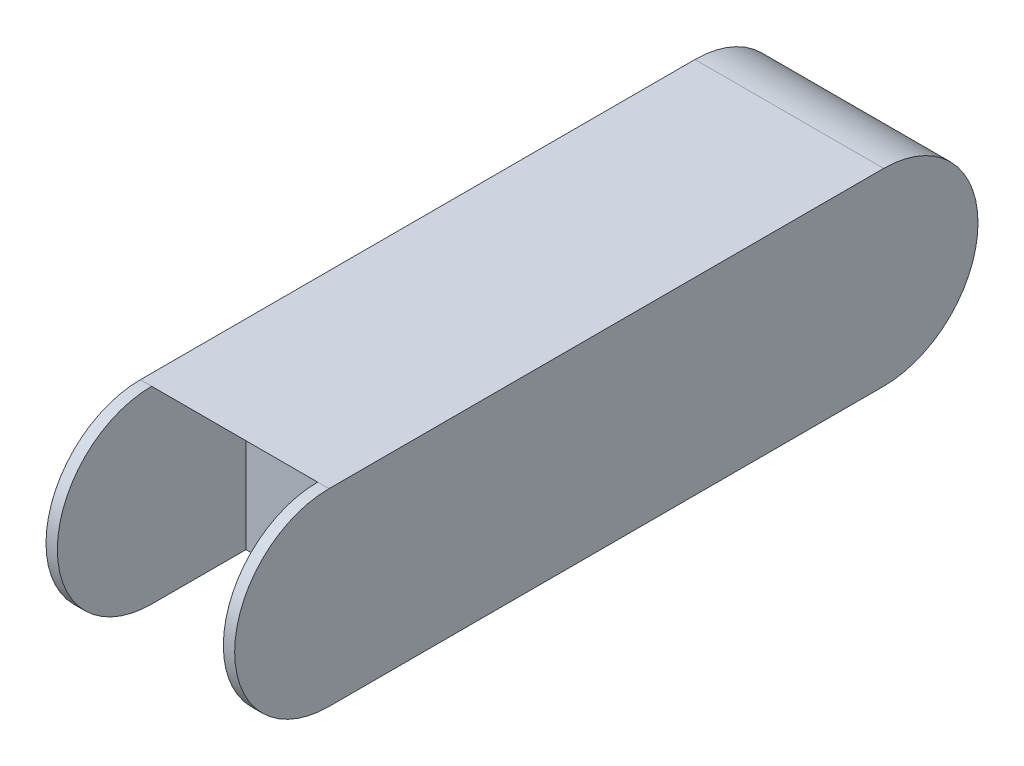
ISO-10303-21;
HEADER;
FILE_DESCRIPTION(('STEP AP214'),'2;1');
FILE_NAME('part.step','',(''),(''),'','','');
FILE_SCHEMA(('AUTOMOTIVE_DESIGN { 1 0 10303 214 1 1 1 1 }'));
ENDSEC;
DATA;
#1=APPLICATION_CONTEXT('core data for automotive mechanical design processes');
#2=APPLICATION_PROTOCOL_DEFINITION('international standard','automotive_design',2000,#1);
#3=PRODUCT_CONTEXT('',#1,'mechanical');
#4=PRODUCT('Part','Part','',(#3));
#5=PRODUCT_RELATED_PRODUCT_CATEGORY('part','',(#4));
#6=PRODUCT_DEFINITION_FORMATION('','',#4);
#7=PRODUCT_DEFINITION_CONTEXT('part definition',#1,'design');
#8=PRODUCT_DEFINITION('design','',#6,#7);
#9=PRODUCT_DEFINITION_SHAPE('','',#8);
#10=(LENGTH_UNIT() NAMED_UNIT(*) SI_UNIT(.MILLI.,.METRE.));
#11=(NAMED_UNIT(*) PLANE_ANGLE_UNIT() SI_UNIT($,.RADIAN.));
#12=(NAMED_UNIT(*) SI_UNIT($,.STERADIAN.) SOLID_ANGLE_UNIT());
#13=UNCERTAINTY_MEASURE_WITH_UNIT(LENGTH_MEASURE(1.E-05),#10,'distance_accuracy_value','');
#14=(GEOMETRIC_REPRESENTATION_CONTEXT(3) GLOBAL_UNCERTAINTY_ASSIGNED_CONTEXT((#13)) GLOBAL_UNIT_ASSIGNED_CONTEXT((#10,
#11,#12)) REPRESENTATION_CONTEXT('',''));
#15=CARTESIAN_POINT('',(0.,0.,0.));
#16=DIRECTION('',(0.,0.,1.));
#17=DIRECTION('',(1.,0.,0.));
#18=AXIS2_PLACEMENT_3D('',#15,#16,#17);
#19=CARTESIAN_POINT('',(0.,0.025,-0.025));
#20=DIRECTION('',(0.,0.,-1.));
#21=DIRECTION('',(-1.,0.,0.));
#22=AXIS2_PLACEMENT_3D('',#19,#20,#21);
#23=PLANE('',#22);
#24=DIRECTION('',(1.,0.,0.));
#25=VECTOR('',#24,1.);
#26=CARTESIAN_POINT('',(0.,0.,-0.025));
#27=LINE('',#26,#25);
#28=CARTESIAN_POINT('',(0.003,0.,-0.025));
#29=VERTEX_POINT('',#28);
#30=CARTESIAN_POINT('',(0.047,0.,-0.025));
#31=VERTEX_POINT('',#30);
#32=EDGE_CURVE('E107',#29,#31,#27,.T.);
#33=ORIENTED_EDGE('',*,*,#32,.T.);
#34=DIRECTION('',(0.,1.,0.));
#35=VECTOR('',#34,1.);
#36=CARTESIAN_POINT('',(0.047,0.025,-0.025));
#37=LINE('',#36,#35);
#38=CARTESIAN_POINT('',(0.047,0.025,-0.025));
#39=VERTEX_POINT('',#38);
#40=EDGE_CURVE('E101',#31,#39,#37,.T.);
#41=ORIENTED_EDGE('',*,*,#40,.T.);
#42=DIRECTION('',(1.,0.,0.));
#43=VECTOR('',#42,1.);
#44=CARTESIAN_POINT('',(0.,0.025,-0.025));
#45=LINE('',#44,#43);
#46=CARTESIAN_POINT('',(0.003,0.0249999999999998,-0.025));
#47=VERTEX_POINT('',#46);
#48=EDGE_CURVE('E104',#47,#39,#45,.T.);
#49=ORIENTED_EDGE('',*,*,#48,.F.);
#50=DIRECTION('',(0.,-1.,0.));
#51=VECTOR('',#50,1.);
#52=CARTESIAN_POINT('',(0.003,0.0249999999999998,-0.025));
#53=LINE('',#52,#51);
#54=EDGE_CURVE('E167',#47,#29,#53,.T.);
#55=ORIENTED_EDGE('',*,*,#54,.T.);
#56=EDGE_LOOP('',(#33,#41,#49,#55));
#57=FACE_BOUND('',#56,.T.);
#58=ADVANCED_FACE('F34',(#57),#23,.F.);
#59=CARTESIAN_POINT('',(0.003,0.025,0.));
#60=DIRECTION('',(-1.,0.,0.));
#61=DIRECTION('',(0.,0.,1.));
#62=AXIS2_PLACEMENT_3D('',#59,#60,#61);
#63=CYLINDRICAL_SURFACE('',#62,0.025);
#64=CARTESIAN_POINT('',(0.,0.025,0.));
#65=DIRECTION('',(-1.,0.,0.));
#66=DIRECTION('',(0.,0.,1.));
#67=AXIS2_PLACEMENT_3D('',#64,#65,#66);
#68=CIRCLE('',#67,0.025);
#69=CARTESIAN_POINT('',(0.,0.,0.));
#70=VERTEX_POINT('',#69);
#71=CARTESIAN_POINT('',(0.,0.05,0.));
#72=VERTEX_POINT('',#71);
#73=EDGE_CURVE('E160',#70,#72,#68,.T.);
#74=ORIENTED_EDGE('',*,*,#73,.F.);
#75=DIRECTION('',(-1.,0.,0.));
#76=VECTOR('',#75,1.);
#77=CARTESIAN_POINT('',(0.003,0.,0.));
#78=LINE('',#77,#76);
#79=CARTESIAN_POINT('',(0.003,0.,0.));
#80=VERTEX_POINT('',#79);
#81=EDGE_CURVE('E161',#80,#70,#78,.T.);
#82=ORIENTED_EDGE('',*,*,#81,.F.);
#83=CARTESIAN_POINT('',(0.003,0.025,0.));
#84=DIRECTION('',(-1.,0.,0.));
#85=DIRECTION('',(0.,0.,1.));
#86=AXIS2_PLACEMENT_3D('',#83,#84,#85);
#87=CIRCLE('',#86,0.025);
#88=CARTESIAN_POINT('',(0.003,0.05,0.));
#89=VERTEX_POINT('',#88);
#90=EDGE_CURVE('E57',#80,#89,#87,.T.);
#91=ORIENTED_EDGE('',*,*,#90,.T.);
#92=DIRECTION('',(-1.,0.,0.));
#93=VECTOR('',#92,1.);
#94=CARTESIAN_POINT('',(0.003,0.05,0.));
#95=LINE('',#94,#93);
#96=EDGE_CURVE('E129',#89,#72,#95,.T.);
#97=ORIENTED_EDGE('',*,*,#96,.T.);
#98=EDGE_LOOP('',(#74,#82,#91,#97));
#99=FACE_BOUND('',#98,.T.);
#100=ADVANCED_FACE('F179',(#99),#63,.T.);
#101=CARTESIAN_POINT('',(0.05,0.025,0.));
#102=DIRECTION('',(-1.,0.,0.));
#103=DIRECTION('',(0.,0.,1.));
#104=AXIS2_PLACEMENT_3D('',#101,#102,#103);
#105=CYLINDRICAL_SURFACE('',#104,0.025);
#106=EDGE_CURVE('E119',#89,#47,#87,.T.);
#107=ORIENTED_EDGE('',*,*,#106,.T.);
#108=ORIENTED_EDGE('',*,*,#48,.T.);
#109=CARTESIAN_POINT('',(0.047,0.025,0.));
#110=DIRECTION('',(1.,0.,0.));
#111=DIRECTION('',(0.,0.,-1.));
#112=AXIS2_PLACEMENT_3D('',#109,#110,#111);
#113=CIRCLE('',#112,0.025);
#114=CARTESIAN_POINT('',(0.047,0.05,0.));
#115=VERTEX_POINT('',#114);
#116=EDGE_CURVE('E116',#39,#115,#113,.T.);
#117=ORIENTED_EDGE('',*,*,#116,.T.);
#118=DIRECTION('',(-1.,0.,0.));
#119=VECTOR('',#118,1.);
#120=CARTESIAN_POINT('',(0.05,0.05,0.));
#121=LINE('',#120,#119);
#122=EDGE_CURVE('E141',#115,#89,#121,.T.);
#123=ORIENTED_EDGE('',*,*,#122,.T.);
#124=EDGE_LOOP('',(#107,#108,#117,#123));
#125=FACE_BOUND('',#124,.T.);
#126=ADVANCED_FACE('F36',(#125),#105,.F.);
#127=CARTESIAN_POINT('',(0.05,0.,0.));
#128=DIRECTION('',(0.,1.,0.));
#129=DIRECTION('',(0.,0.,1.));
#130=AXIS2_PLACEMENT_3D('',#127,#128,#129);
#131=PLANE('',#130);
#132=DIRECTION('',(0.,0.,-1.));
#133=VECTOR('',#132,1.);
#134=CARTESIAN_POINT('',(0.05,0.,0.));
#135=LINE('',#134,#133);
#136=CARTESIAN_POINT('',(0.05,0.,0.));
#137=VERTEX_POINT('',#136);
#138=CARTESIAN_POINT('',(0.05,0.,-0.147));
#139=VERTEX_POINT('',#138);
#140=EDGE_CURVE('E134',#137,#139,#135,.T.);
#141=ORIENTED_EDGE('',*,*,#140,.F.);
#142=DIRECTION('',(1.,0.,0.));
#143=VECTOR('',#142,1.);
#144=CARTESIAN_POINT('',(0.047,0.,0.));
#145=LINE('',#144,#143);
#146=CARTESIAN_POINT('',(0.047,0.,0.));
#147=VERTEX_POINT('',#146);
#148=EDGE_CURVE('E169',#147,#137,#145,.T.);
#149=ORIENTED_EDGE('',*,*,#148,.F.);
#150=DIRECTION('',(0.,0.,-1.));
#151=VECTOR('',#150,1.);
#152=CARTESIAN_POINT('',(0.047,0.,-0.025));
#153=LINE('',#152,#151);
#154=EDGE_CURVE('E112',#147,#31,#153,.T.);
#155=ORIENTED_EDGE('',*,*,#154,.T.);
#156=ORIENTED_EDGE('',*,*,#32,.F.);
#157=DIRECTION('',(0.,0.,1.));
#158=VECTOR('',#157,1.);
#159=CARTESIAN_POINT('',(0.003,0.,-0.025));
#160=LINE('',#159,#158);
#161=EDGE_CURVE('E163',#29,#80,#160,.T.);
#162=ORIENTED_EDGE('',*,*,#161,.T.);
#163=ORIENTED_EDGE('',*,*,#81,.T.);
#164=DIRECTION('',(0.,0.,-1.));
#165=VECTOR('',#164,1.);
#166=CARTESIAN_POINT('',(0.,0.,0.));
#167=LINE('',#166,#165);
#168=CARTESIAN_POINT('',(0.,0.,-0.147));
#169=VERTEX_POINT('',#168);
#170=EDGE_CURVE('E49',#70,#169,#167,.T.);
#171=ORIENTED_EDGE('',*,*,#170,.T.);
#172=DIRECTION('',(-1.,0.,0.));
#173=VECTOR('',#172,1.);
#174=CARTESIAN_POINT('',(0.05,0.,-0.147));
#175=LINE('',#174,#173);
#176=EDGE_CURVE('E11',#139,#169,#175,.T.);
#177=ORIENTED_EDGE('',*,*,#176,.F.);
#178=EDGE_LOOP('',(#141,#149,#155,#156,#162,#163,#171,#177));
#179=FACE_BOUND('',#178,.T.);
#180=ADVANCED_FACE('F173',(#179),#131,.F.);
#181=CARTESIAN_POINT('',(0.05,0.025,-0.147));
#182=DIRECTION('',(-1.,0.,0.));
#183=DIRECTION('',(0.,0.,1.));
#184=AXIS2_PLACEMENT_3D('',#181,#182,#183);
#185=CYLINDRICAL_SURFACE('',#184,0.025);
#186=CARTESIAN_POINT('',(0.,0.025,-0.147));
#187=DIRECTION('',(1.,0.,0.));
#188=DIRECTION('',(0.,0.,-1.));
#189=AXIS2_PLACEMENT_3D('',#186,#187,#188);
#190=CIRCLE('',#189,0.025);
#191=CARTESIAN_POINT('',(0.,0.05,-0.147));
#192=VERTEX_POINT('',#191);
#193=EDGE_CURVE('E143',#169,#192,#190,.T.);
#194=ORIENTED_EDGE('',*,*,#193,.T.);
#195=DIRECTION('',(-1.,0.,0.));
#196=VECTOR('',#195,1.);
#197=CARTESIAN_POINT('',(0.05,0.05,-0.147));
#198=LINE('',#197,#196);
#199=CARTESIAN_POINT('',(0.05,0.05,-0.147));
#200=VERTEX_POINT('',#199);
#201=EDGE_CURVE('E42',#200,#192,#198,.T.);
#202=ORIENTED_EDGE('',*,*,#201,.F.);
#203=CARTESIAN_POINT('',(0.05,0.025,-0.147));
#204=DIRECTION('',(1.,0.,0.));
#205=DIRECTION('',(0.,0.,-1.));
#206=AXIS2_PLACEMENT_3D('',#203,#204,#205);
#207=CIRCLE('',#206,0.025);
#208=EDGE_CURVE('E136',#139,#200,#207,.T.);
#209=ORIENTED_EDGE('',*,*,#208,.F.);
#210=ORIENTED_EDGE('',*,*,#176,.T.);
#211=EDGE_LOOP('',(#194,#202,#209,#210));
#212=FACE_BOUND('',#211,.T.);
#213=ADVANCED_FACE('F201',(#212),#185,.T.);
#214=CARTESIAN_POINT('',(0.05,0.05,0.));
#215=DIRECTION('',(0.,-1.,0.));
#216=DIRECTION('',(0.,0.,-1.));
#217=AXIS2_PLACEMENT_3D('',#214,#215,#216);
#218=PLANE('',#217);
#219=DIRECTION('',(0.,0.,1.));
#220=VECTOR('',#219,1.);
#221=CARTESIAN_POINT('',(0.,0.05,0.));
#222=LINE('',#221,#220);
#223=EDGE_CURVE('E137',#192,#72,#222,.T.);
#224=ORIENTED_EDGE('',*,*,#223,.T.);
#225=ORIENTED_EDGE('',*,*,#96,.F.);
#226=ORIENTED_EDGE('',*,*,#122,.F.);
#227=CARTESIAN_POINT('',(0.05,0.05,0.));
#228=VERTEX_POINT('',#227);
#229=EDGE_CURVE('E147',#228,#115,#121,.T.);
#230=ORIENTED_EDGE('',*,*,#229,.F.);
#231=DIRECTION('',(0.,0.,1.));
#232=VECTOR('',#231,1.);
#233=CARTESIAN_POINT('',(0.05,0.05,0.));
#234=LINE('',#233,#232);
#235=EDGE_CURVE('E139',#200,#228,#234,.T.);
#236=ORIENTED_EDGE('',*,*,#235,.F.);
#237=ORIENTED_EDGE('',*,*,#201,.T.);
#238=EDGE_LOOP('',(#224,#225,#226,#230,#236,#237));
#239=FACE_BOUND('',#238,.T.);
#240=ADVANCED_FACE('F154',(#239),#218,.F.);
#241=CARTESIAN_POINT('',(0.05,0.025,0.));
#242=DIRECTION('',(1.,0.,0.));
#243=DIRECTION('',(0.,0.,-1.));
#244=AXIS2_PLACEMENT_3D('',#241,#242,#243);
#245=PLANE('',#244);
#246=CARTESIAN_POINT('',(0.05,0.025,0.));
#247=DIRECTION('',(1.,0.,0.));
#248=DIRECTION('',(0.,0.,-1.));
#249=AXIS2_PLACEMENT_3D('',#246,#247,#248);
#250=CIRCLE('',#249,0.025);
#251=EDGE_CURVE('E126',#228,#137,#250,.T.);
#252=ORIENTED_EDGE('',*,*,#251,.T.);
#253=ORIENTED_EDGE('',*,*,#140,.T.);
#254=ORIENTED_EDGE('',*,*,#208,.T.);
#255=ORIENTED_EDGE('',*,*,#235,.T.);
#256=EDGE_LOOP('',(#252,#253,#254,#255));
#257=FACE_BOUND('',#256,.T.);
#258=ADVANCED_FACE('F193',(#257),#245,.T.);
#259=CARTESIAN_POINT('',(0.,0.025,0.));
#260=DIRECTION('',(1.,0.,0.));
#261=DIRECTION('',(0.,0.,-1.));
#262=AXIS2_PLACEMENT_3D('',#259,#260,#261);
#263=PLANE('',#262);
#264=ORIENTED_EDGE('',*,*,#170,.F.);
#265=ORIENTED_EDGE('',*,*,#73,.T.);
#266=ORIENTED_EDGE('',*,*,#223,.F.);
#267=ORIENTED_EDGE('',*,*,#193,.F.);
#268=EDGE_LOOP('',(#264,#265,#266,#267));
#269=FACE_BOUND('',#268,.T.);
#270=ADVANCED_FACE('F158',(#269),#263,.F.);
#271=CARTESIAN_POINT('',(0.047,0.025,0.));
#272=DIRECTION('',(1.,0.,0.));
#273=DIRECTION('',(0.,0.,-1.));
#274=AXIS2_PLACEMENT_3D('',#271,#272,#273);
#275=CYLINDRICAL_SURFACE('',#274,0.025);
#276=ORIENTED_EDGE('',*,*,#148,.T.);
#277=ORIENTED_EDGE('',*,*,#251,.F.);
#278=ORIENTED_EDGE('',*,*,#229,.T.);
#279=EDGE_CURVE('E124',#115,#147,#113,.T.);
#280=ORIENTED_EDGE('',*,*,#279,.T.);
#281=EDGE_LOOP('',(#276,#277,#278,#280));
#282=FACE_BOUND('',#281,.T.);
#283=ADVANCED_FACE('F175',(#282),#275,.T.);
#284=CARTESIAN_POINT('',(0.047,0.025,0.));
#285=DIRECTION('',(1.,0.,0.));
#286=DIRECTION('',(0.,0.,-1.));
#287=AXIS2_PLACEMENT_3D('',#284,#285,#286);
#288=PLANE('',#287);
#289=ORIENTED_EDGE('',*,*,#116,.F.);
#290=ORIENTED_EDGE('',*,*,#40,.F.);
#291=ORIENTED_EDGE('',*,*,#154,.F.);
#292=ORIENTED_EDGE('',*,*,#279,.F.);
#293=EDGE_LOOP('',(#289,#290,#291,#292));
#294=FACE_BOUND('',#293,.T.);
#295=ADVANCED_FACE('F122',(#294),#288,.F.);
#296=CARTESIAN_POINT('',(0.003,0.025,0.));
#297=DIRECTION('',(-1.,0.,0.));
#298=DIRECTION('',(0.,0.,1.));
#299=AXIS2_PLACEMENT_3D('',#296,#297,#298);
#300=PLANE('',#299);
#301=ORIENTED_EDGE('',*,*,#90,.F.);
#302=ORIENTED_EDGE('',*,*,#161,.F.);
#303=ORIENTED_EDGE('',*,*,#54,.F.);
#304=ORIENTED_EDGE('',*,*,#106,.F.);
#305=EDGE_LOOP('',(#301,#302,#303,#304));
#306=FACE_BOUND('',#305,.T.);
#307=ADVANCED_FACE('F178',(#306),#300,.F.);
#308=CLOSED_SHELL('',(#58,#100,#126,#180,#213,#240,#258,#270,#283,#295,#307));
#309=MANIFOLD_SOLID_BREP('B2',#308);
#310=ADVANCED_BREP_SHAPE_REPRESENTATION('',(#18,#309),#14);
#311=SHAPE_DEFINITION_REPRESENTATION(#9,#310);
ENDSEC;
END-ISO-10303-21;
